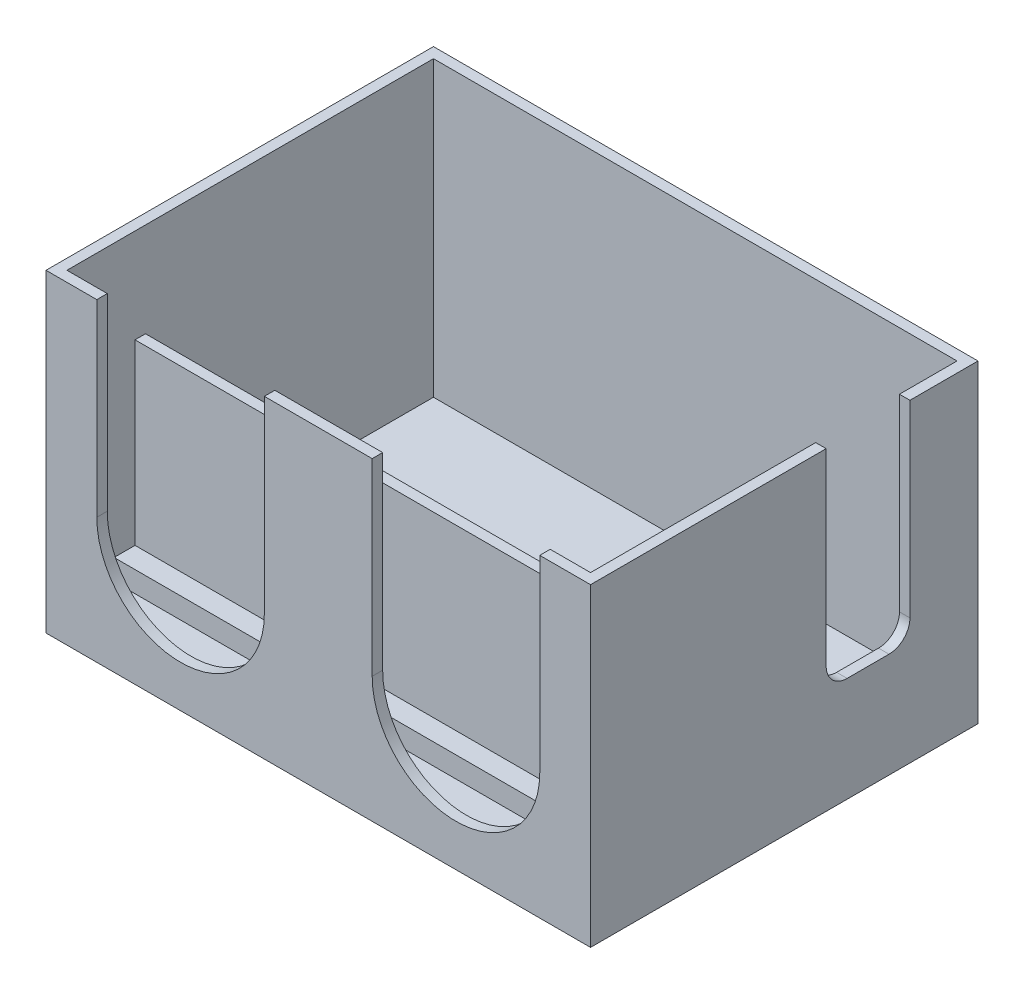
ISO-10303-21;
HEADER;
FILE_DESCRIPTION(('STEP AP214'),'2;1');
FILE_NAME('part.step','',(''),(''),'','','');
FILE_SCHEMA(('AUTOMOTIVE_DESIGN { 1 0 10303 214 1 1 1 1 }'));
ENDSEC;
DATA;
#1=APPLICATION_CONTEXT('core data for automotive mechanical design processes');
#2=APPLICATION_PROTOCOL_DEFINITION('international standard','automotive_design',2000,#1);
#3=PRODUCT_CONTEXT('',#1,'mechanical');
#4=PRODUCT('Part','Part','',(#3));
#5=PRODUCT_RELATED_PRODUCT_CATEGORY('part','',(#4));
#6=PRODUCT_DEFINITION_FORMATION('','',#4);
#7=PRODUCT_DEFINITION_CONTEXT('part definition',#1,'design');
#8=PRODUCT_DEFINITION('design','',#6,#7);
#9=PRODUCT_DEFINITION_SHAPE('','',#8);
#10=(LENGTH_UNIT() NAMED_UNIT(*) SI_UNIT(.MILLI.,.METRE.));
#11=(NAMED_UNIT(*) PLANE_ANGLE_UNIT() SI_UNIT($,.RADIAN.));
#12=(NAMED_UNIT(*) SI_UNIT($,.STERADIAN.) SOLID_ANGLE_UNIT());
#13=UNCERTAINTY_MEASURE_WITH_UNIT(LENGTH_MEASURE(1.E-05),#10,'distance_accuracy_value','');
#14=(GEOMETRIC_REPRESENTATION_CONTEXT(3) GLOBAL_UNCERTAINTY_ASSIGNED_CONTEXT((#13)) GLOBAL_UNIT_ASSIGNED_CONTEXT((#10,
#11,#12)) REPRESENTATION_CONTEXT('',''));
#15=CARTESIAN_POINT('',(0.,0.,0.));
#16=DIRECTION('',(0.,0.,1.));
#17=DIRECTION('',(1.,0.,0.));
#18=AXIS2_PLACEMENT_3D('',#15,#16,#17);
#19=CARTESIAN_POINT('',(0.999999999999999,30.,-0.999999999999992));
#20=DIRECTION('',(1.,0.,0.));
#21=DIRECTION('',(0.,0.,-1.));
#22=AXIS2_PLACEMENT_3D('',#19,#20,#21);
#23=PLANE('',#22);
#24=DIRECTION('',(0.,0.,1.));
#25=VECTOR('',#24,1.);
#26=CARTESIAN_POINT('',(0.999999999999997,21.,-7.49999999999999));
#27=LINE('',#26,#25);
#28=CARTESIAN_POINT('',(0.999999999999998,21.,-8.49999999999999));
#29=VERTEX_POINT('',#28);
#30=CARTESIAN_POINT('',(0.999999999999997,21.,-7.49999999999999));
#31=VERTEX_POINT('',#30);
#32=EDGE_CURVE('E276',#29,#31,#27,.T.);
#33=ORIENTED_EDGE('',*,*,#32,.F.);
#34=DIRECTION('',(0.,-1.,0.));
#35=VECTOR('',#34,1.);
#36=CARTESIAN_POINT('',(0.999999999999998,21.,-8.49999999999999));
#37=LINE('',#36,#35);
#38=CARTESIAN_POINT('',(0.999999999999998,2.,-8.49999999999999));
#39=VERTEX_POINT('',#38);
#40=EDGE_CURVE('E273',#29,#39,#37,.T.);
#41=ORIENTED_EDGE('',*,*,#40,.T.);
#42=DIRECTION('',(0.,0.,1.));
#43=VECTOR('',#42,1.);
#44=CARTESIAN_POINT('',(0.999999999999999,2.,-0.999999999999992));
#45=LINE('',#44,#43);
#46=CARTESIAN_POINT('',(0.999999999999998,2.,-13.5));
#47=VERTEX_POINT('',#46);
#48=EDGE_CURVE('E603',#47,#39,#45,.T.);
#49=ORIENTED_EDGE('',*,*,#48,.F.);
#50=DIRECTION('',(0.,-1.,0.));
#51=VECTOR('',#50,1.);
#52=CARTESIAN_POINT('',(0.999999999999996,4.,-13.5));
#53=LINE('',#52,#51);
#54=CARTESIAN_POINT('',(0.999999999999996,4.,-13.5));
#55=VERTEX_POINT('',#54);
#56=EDGE_CURVE('E376',#55,#47,#53,.T.);
#57=ORIENTED_EDGE('',*,*,#56,.F.);
#58=DIRECTION('',(0.,0.,1.));
#59=VECTOR('',#58,1.);
#60=CARTESIAN_POINT('',(0.999999999999996,4.,-13.5));
#61=LINE('',#60,#59);
#62=CARTESIAN_POINT('',(0.999999999999996,4.,-15.5));
#63=VERTEX_POINT('',#62);
#64=EDGE_CURVE('E366',#63,#55,#61,.T.);
#65=ORIENTED_EDGE('',*,*,#64,.F.);
#66=DIRECTION('',(0.,-1.,0.));
#67=VECTOR('',#66,1.);
#68=CARTESIAN_POINT('',(0.999999999999996,4.,-15.5));
#69=LINE('',#68,#67);
#70=CARTESIAN_POINT('',(0.999999999999996,2.,-15.5));
#71=VERTEX_POINT('',#70);
#72=EDGE_CURVE('E378',#63,#71,#69,.T.);
#73=ORIENTED_EDGE('',*,*,#72,.T.);
#74=CARTESIAN_POINT('',(0.999999999999997,2.,-17.25));
#75=VERTEX_POINT('',#74);
#76=EDGE_CURVE('E448',#75,#71,#45,.T.);
#77=ORIENTED_EDGE('',*,*,#76,.F.);
#78=DIRECTION('',(0.,-1.,0.));
#79=VECTOR('',#78,1.);
#80=CARTESIAN_POINT('',(0.999999999999996,4.,-17.25));
#81=LINE('',#80,#79);
#82=CARTESIAN_POINT('',(0.999999999999996,4.,-17.25));
#83=VERTEX_POINT('',#82);
#84=EDGE_CURVE('E56',#83,#75,#81,.T.);
#85=ORIENTED_EDGE('',*,*,#84,.F.);
#86=DIRECTION('',(0.,0.,1.));
#87=VECTOR('',#86,1.);
#88=CARTESIAN_POINT('',(0.999999999999996,4.,-17.25));
#89=LINE('',#88,#87);
#90=CARTESIAN_POINT('',(0.999999999999996,4.,-19.25));
#91=VERTEX_POINT('',#90);
#92=EDGE_CURVE('E344',#91,#83,#89,.T.);
#93=ORIENTED_EDGE('',*,*,#92,.F.);
#94=DIRECTION('',(0.,-1.,0.));
#95=VECTOR('',#94,1.);
#96=CARTESIAN_POINT('',(0.999999999999996,4.,-19.25));
#97=LINE('',#96,#95);
#98=CARTESIAN_POINT('',(0.999999999999996,2.,-19.25));
#99=VERTEX_POINT('',#98);
#100=EDGE_CURVE('E354',#91,#99,#97,.T.);
#101=ORIENTED_EDGE('',*,*,#100,.T.);
#102=CARTESIAN_POINT('',(0.999999999999996,2.,-36.));
#103=VERTEX_POINT('',#102);
#104=EDGE_CURVE('E444',#103,#99,#45,.T.);
#105=ORIENTED_EDGE('',*,*,#104,.F.);
#106=DIRECTION('',(0.,-1.,0.));
#107=VECTOR('',#106,1.);
#108=CARTESIAN_POINT('',(0.999999999999996,30.,-36.));
#109=LINE('',#108,#107);
#110=CARTESIAN_POINT('',(0.999999999999996,30.,-36.));
#111=VERTEX_POINT('',#110);
#112=EDGE_CURVE('E461',#111,#103,#109,.T.);
#113=ORIENTED_EDGE('',*,*,#112,.F.);
#114=DIRECTION('',(0.,0.,1.));
#115=VECTOR('',#114,1.);
#116=CARTESIAN_POINT('',(0.999999999999999,30.,-0.999999999999992));
#117=LINE('',#116,#115);
#118=CARTESIAN_POINT('',(0.999999999999999,30.,-0.999999999999992));
#119=VERTEX_POINT('',#118);
#120=EDGE_CURVE('E447',#111,#119,#117,.T.);
#121=ORIENTED_EDGE('',*,*,#120,.T.);
#122=DIRECTION('',(0.,-1.,0.));
#123=VECTOR('',#122,1.);
#124=CARTESIAN_POINT('',(0.999999999999999,30.,-0.999999999999992));
#125=LINE('',#124,#123);
#126=CARTESIAN_POINT('',(0.999999999999999,2.,-0.999999999999992));
#127=VERTEX_POINT('',#126);
#128=EDGE_CURVE('E469',#119,#127,#125,.T.);
#129=ORIENTED_EDGE('',*,*,#128,.T.);
#130=CARTESIAN_POINT('',(0.999999999999996,2.,-5.49999999999999));
#131=VERTEX_POINT('',#130);
#132=EDGE_CURVE('E443',#131,#127,#45,.T.);
#133=ORIENTED_EDGE('',*,*,#132,.F.);
#134=DIRECTION('',(0.,-1.,0.));
#135=VECTOR('',#134,1.);
#136=CARTESIAN_POINT('',(0.999999999999996,4.,-5.49999999999999));
#137=LINE('',#136,#135);
#138=CARTESIAN_POINT('',(0.999999999999996,4.,-5.49999999999999));
#139=VERTEX_POINT('',#138);
#140=EDGE_CURVE('E399',#139,#131,#137,.T.);
#141=ORIENTED_EDGE('',*,*,#140,.F.);
#142=DIRECTION('',(0.,0.,1.));
#143=VECTOR('',#142,1.);
#144=CARTESIAN_POINT('',(0.999999999999996,4.,-5.49999999999999));
#145=LINE('',#144,#143);
#146=CARTESIAN_POINT('',(0.999999999999996,4.,-7.49999999999999));
#147=VERTEX_POINT('',#146);
#148=EDGE_CURVE('E384',#147,#139,#145,.T.);
#149=ORIENTED_EDGE('',*,*,#148,.F.);
#150=DIRECTION('',(0.,-1.,0.));
#151=VECTOR('',#150,1.);
#152=CARTESIAN_POINT('',(0.999999999999997,21.,-7.49999999999999));
#153=LINE('',#152,#151);
#154=EDGE_CURVE('E297',#31,#147,#153,.T.);
#155=ORIENTED_EDGE('',*,*,#154,.F.);
#156=EDGE_LOOP('',(#33,#41,#49,#57,#65,#73,#77,#85,#93,#101,#105,#113,#121,#129,#133,#141,#149,#155));
#157=FACE_BOUND('',#156,.T.);
#158=ADVANCED_FACE('F33',(#157),#23,.T.);
#159=CARTESIAN_POINT('',(51.,30.,-0.999999999999995));
#160=DIRECTION('',(-1.,0.,0.));
#161=DIRECTION('',(0.,0.,1.));
#162=AXIS2_PLACEMENT_3D('',#159,#160,#161);
#163=PLANE('',#162);
#164=DIRECTION('',(0.,0.,-1.));
#165=VECTOR('',#164,1.);
#166=CARTESIAN_POINT('',(51.,2.,-0.999999999999995));
#167=LINE('',#166,#165);
#168=CARTESIAN_POINT('',(51.,2.,-8.49999999999999));
#169=VERTEX_POINT('',#168);
#170=CARTESIAN_POINT('',(51.,2.,-13.5));
#171=VERTEX_POINT('',#170);
#172=EDGE_CURVE('E291',#169,#171,#167,.T.);
#173=ORIENTED_EDGE('',*,*,#172,.F.);
#174=DIRECTION('',(0.,-1.,0.));
#175=VECTOR('',#174,1.);
#176=CARTESIAN_POINT('',(51.,21.,-8.49999999999999));
#177=LINE('',#176,#175);
#178=CARTESIAN_POINT('',(51.,21.,-8.49999999999999));
#179=VERTEX_POINT('',#178);
#180=EDGE_CURVE('E270',#179,#169,#177,.T.);
#181=ORIENTED_EDGE('',*,*,#180,.F.);
#182=DIRECTION('',(0.,0.,-1.));
#183=VECTOR('',#182,1.);
#184=CARTESIAN_POINT('',(51.,21.,-7.49999999999999));
#185=LINE('',#184,#183);
#186=CARTESIAN_POINT('',(51.,21.,-7.49999999999999));
#187=VERTEX_POINT('',#186);
#188=EDGE_CURVE('E277',#187,#179,#185,.T.);
#189=ORIENTED_EDGE('',*,*,#188,.F.);
#190=DIRECTION('',(0.,-1.,0.));
#191=VECTOR('',#190,1.);
#192=CARTESIAN_POINT('',(51.,21.,-7.49999999999999));
#193=LINE('',#192,#191);
#194=CARTESIAN_POINT('',(51.,4.,-7.49999999999999));
#195=VERTEX_POINT('',#194);
#196=EDGE_CURVE('E713',#187,#195,#193,.T.);
#197=ORIENTED_EDGE('',*,*,#196,.T.);
#198=DIRECTION('',(0.,0.,-1.));
#199=VECTOR('',#198,1.);
#200=CARTESIAN_POINT('',(51.,4.,-5.49999999999999));
#201=LINE('',#200,#199);
#202=CARTESIAN_POINT('',(51.,4.,-5.49999999999999));
#203=VERTEX_POINT('',#202);
#204=EDGE_CURVE('E389',#203,#195,#201,.T.);
#205=ORIENTED_EDGE('',*,*,#204,.F.);
#206=DIRECTION('',(0.,-1.,0.));
#207=VECTOR('',#206,1.);
#208=CARTESIAN_POINT('',(51.,4.,-5.49999999999999));
#209=LINE('',#208,#207);
#210=CARTESIAN_POINT('',(51.,2.,-5.49999999999999));
#211=VERTEX_POINT('',#210);
#212=EDGE_CURVE('E395',#203,#211,#209,.T.);
#213=ORIENTED_EDGE('',*,*,#212,.T.);
#214=CARTESIAN_POINT('',(51.,2.,-0.999999999999995));
#215=VERTEX_POINT('',#214);
#216=EDGE_CURVE('E436',#215,#211,#167,.T.);
#217=ORIENTED_EDGE('',*,*,#216,.F.);
#218=DIRECTION('',(0.,-1.,0.));
#219=VECTOR('',#218,1.);
#220=CARTESIAN_POINT('',(51.,30.,-0.999999999999995));
#221=LINE('',#220,#219);
#222=CARTESIAN_POINT('',(51.,30.,-0.999999999999995));
#223=VERTEX_POINT('',#222);
#224=EDGE_CURVE('E466',#223,#215,#221,.T.);
#225=ORIENTED_EDGE('',*,*,#224,.F.);
#226=DIRECTION('',(0.,0.,-1.));
#227=VECTOR('',#226,1.);
#228=CARTESIAN_POINT('',(51.,30.,-0.999999999999995));
#229=LINE('',#228,#227);
#230=CARTESIAN_POINT('',(51.,30.,-22.5));
#231=VERTEX_POINT('',#230);
#232=EDGE_CURVE('E456',#223,#231,#229,.T.);
#233=ORIENTED_EDGE('',*,*,#232,.T.);
#234=DIRECTION('',(0.,-1.,0.));
#235=VECTOR('',#234,1.);
#236=CARTESIAN_POINT('',(51.,30.,-22.5));
#237=LINE('',#236,#235);
#238=CARTESIAN_POINT('',(51.,12.,-22.5));
#239=VERTEX_POINT('',#238);
#240=EDGE_CURVE('E327',#231,#239,#237,.T.);
#241=ORIENTED_EDGE('',*,*,#240,.T.);
#242=CARTESIAN_POINT('',(51.,12.,-24.5));
#243=DIRECTION('',(-1.,0.,0.));
#244=DIRECTION('',(0.,0.,1.));
#245=AXIS2_PLACEMENT_3D('',#242,#243,#244);
#246=CIRCLE('',#245,2.);
#247=CARTESIAN_POINT('',(51.,9.99999999999999,-24.5));
#248=VERTEX_POINT('',#247);
#249=EDGE_CURVE('E323',#239,#248,#246,.F.);
#250=ORIENTED_EDGE('',*,*,#249,.T.);
#251=DIRECTION('',(0.,0.,-1.));
#252=VECTOR('',#251,1.);
#253=CARTESIAN_POINT('',(51.,10.,-28.5));
#254=LINE('',#253,#252);
#255=CARTESIAN_POINT('',(51.,10.,-28.5));
#256=VERTEX_POINT('',#255);
#257=EDGE_CURVE('E319',#248,#256,#254,.T.);
#258=ORIENTED_EDGE('',*,*,#257,.T.);
#259=CARTESIAN_POINT('',(51.,12.,-28.5));
#260=DIRECTION('',(-1.,0.,0.));
#261=DIRECTION('',(0.,0.,1.));
#262=AXIS2_PLACEMENT_3D('',#259,#260,#261);
#263=CIRCLE('',#262,2.);
#264=CARTESIAN_POINT('',(51.,12.,-30.5));
#265=VERTEX_POINT('',#264);
#266=EDGE_CURVE('E315',#256,#265,#263,.F.);
#267=ORIENTED_EDGE('',*,*,#266,.T.);
#268=DIRECTION('',(0.,1.,0.));
#269=VECTOR('',#268,1.);
#270=CARTESIAN_POINT('',(51.,30.,-30.5));
#271=LINE('',#270,#269);
#272=CARTESIAN_POINT('',(51.,30.,-30.5));
#273=VERTEX_POINT('',#272);
#274=EDGE_CURVE('E292',#265,#273,#271,.T.);
#275=ORIENTED_EDGE('',*,*,#274,.T.);
#276=CARTESIAN_POINT('',(51.,30.,-36.));
#277=VERTEX_POINT('',#276);
#278=EDGE_CURVE('E454',#273,#277,#229,.T.);
#279=ORIENTED_EDGE('',*,*,#278,.T.);
#280=DIRECTION('',(0.,-1.,0.));
#281=VECTOR('',#280,1.);
#282=CARTESIAN_POINT('',(51.,30.,-36.));
#283=LINE('',#282,#281);
#284=CARTESIAN_POINT('',(51.,2.,-36.));
#285=VERTEX_POINT('',#284);
#286=EDGE_CURVE('E463',#277,#285,#283,.T.);
#287=ORIENTED_EDGE('',*,*,#286,.T.);
#288=CARTESIAN_POINT('',(51.,2.,-19.25));
#289=VERTEX_POINT('',#288);
#290=EDGE_CURVE('E414',#289,#285,#167,.T.);
#291=ORIENTED_EDGE('',*,*,#290,.F.);
#292=DIRECTION('',(0.,-1.,0.));
#293=VECTOR('',#292,1.);
#294=CARTESIAN_POINT('',(51.,4.,-19.25));
#295=LINE('',#294,#293);
#296=CARTESIAN_POINT('',(51.,4.,-19.25));
#297=VERTEX_POINT('',#296);
#298=EDGE_CURVE('E357',#297,#289,#295,.T.);
#299=ORIENTED_EDGE('',*,*,#298,.F.);
#300=DIRECTION('',(0.,0.,-1.));
#301=VECTOR('',#300,1.);
#302=CARTESIAN_POINT('',(51.,4.,-17.25));
#303=LINE('',#302,#301);
#304=CARTESIAN_POINT('',(51.,4.,-17.25));
#305=VERTEX_POINT('',#304);
#306=EDGE_CURVE('E338',#305,#297,#303,.T.);
#307=ORIENTED_EDGE('',*,*,#306,.F.);
#308=DIRECTION('',(0.,-1.,0.));
#309=VECTOR('',#308,1.);
#310=CARTESIAN_POINT('',(51.,4.,-17.25));
#311=LINE('',#310,#309);
#312=CARTESIAN_POINT('',(51.,2.,-17.25));
#313=VERTEX_POINT('',#312);
#314=EDGE_CURVE('E348',#305,#313,#311,.T.);
#315=ORIENTED_EDGE('',*,*,#314,.T.);
#316=CARTESIAN_POINT('',(51.,2.,-15.5));
#317=VERTEX_POINT('',#316);
#318=EDGE_CURVE('E440',#317,#313,#167,.T.);
#319=ORIENTED_EDGE('',*,*,#318,.F.);
#320=DIRECTION('',(0.,-1.,0.));
#321=VECTOR('',#320,1.);
#322=CARTESIAN_POINT('',(51.,4.,-15.5));
#323=LINE('',#322,#321);
#324=CARTESIAN_POINT('',(51.,4.,-15.5));
#325=VERTEX_POINT('',#324);
#326=EDGE_CURVE('E381',#325,#317,#323,.T.);
#327=ORIENTED_EDGE('',*,*,#326,.F.);
#328=DIRECTION('',(0.,0.,-1.));
#329=VECTOR('',#328,1.);
#330=CARTESIAN_POINT('',(51.,4.,-13.5));
#331=LINE('',#330,#329);
#332=CARTESIAN_POINT('',(51.,4.,-13.5));
#333=VERTEX_POINT('',#332);
#334=EDGE_CURVE('E360',#333,#325,#331,.T.);
#335=ORIENTED_EDGE('',*,*,#334,.F.);
#336=DIRECTION('',(0.,-1.,0.));
#337=VECTOR('',#336,1.);
#338=CARTESIAN_POINT('',(51.,4.,-13.5));
#339=LINE('',#338,#337);
#340=EDGE_CURVE('E370',#333,#171,#339,.T.);
#341=ORIENTED_EDGE('',*,*,#340,.T.);
#342=EDGE_LOOP('',(#173,#181,#189,#197,#205,#213,#217,#225,#233,#241,#250,#258,#267,#275,#279,
#287,#291,#299,#307,#315,#319,#327,#335,#341));
#343=FACE_BOUND('',#342,.T.);
#344=ADVANCED_FACE('F289',(#343),#163,.T.);
#345=CARTESIAN_POINT('',(0.,2.,0.));
#346=DIRECTION('',(0.,1.,0.));
#347=DIRECTION('',(0.,0.,1.));
#348=AXIS2_PLACEMENT_3D('',#345,#346,#347);
#349=PLANE('',#348);
#350=ORIENTED_EDGE('',*,*,#48,.T.);
#351=DIRECTION('',(-1.,0.,0.));
#352=VECTOR('',#351,1.);
#353=CARTESIAN_POINT('',(51.,2.,-8.49999999999999));
#354=LINE('',#353,#352);
#355=EDGE_CURVE('E286',#169,#39,#354,.T.);
#356=ORIENTED_EDGE('',*,*,#355,.F.);
#357=ORIENTED_EDGE('',*,*,#172,.T.);
#358=DIRECTION('',(1.,0.,0.));
#359=VECTOR('',#358,1.);
#360=CARTESIAN_POINT('',(51.,2.,-13.5));
#361=LINE('',#360,#359);
#362=EDGE_CURVE('E364',#47,#171,#361,.T.);
#363=ORIENTED_EDGE('',*,*,#362,.F.);
#364=EDGE_LOOP('',(#350,#356,#357,#363));
#365=FACE_BOUND('',#364,.T.);
#366=ADVANCED_FACE('F589',(#365),#349,.T.);
#367=CARTESIAN_POINT('',(0.,30.,0.));
#368=DIRECTION('',(0.,-1.,0.));
#369=DIRECTION('',(0.,0.,-1.));
#370=AXIS2_PLACEMENT_3D('',#367,#368,#369);
#371=PLANE('',#370);
#372=ORIENTED_EDGE('',*,*,#278,.F.);
#373=DIRECTION('',(1.,0.,0.));
#374=VECTOR('',#373,1.);
#375=CARTESIAN_POINT('',(-0.001000000000001,30.,-30.5));
#376=LINE('',#375,#374);
#377=CARTESIAN_POINT('',(52.,30.,-30.5));
#378=VERTEX_POINT('',#377);
#379=EDGE_CURVE('E295',#273,#378,#376,.T.);
#380=ORIENTED_EDGE('',*,*,#379,.T.);
#381=DIRECTION('',(0.,0.,-1.));
#382=VECTOR('',#381,1.);
#383=CARTESIAN_POINT('',(52.,30.,0.));
#384=LINE('',#383,#382);
#385=CARTESIAN_POINT('',(52.,30.,-37.));
#386=VERTEX_POINT('',#385);
#387=EDGE_CURVE('E481',#378,#386,#384,.T.);
#388=ORIENTED_EDGE('',*,*,#387,.T.);
#389=DIRECTION('',(-1.,0.,0.));
#390=VECTOR('',#389,1.);
#391=CARTESIAN_POINT('',(0.,30.,-37.));
#392=LINE('',#391,#390);
#393=CARTESIAN_POINT('',(0.,30.,-37.));
#394=VERTEX_POINT('',#393);
#395=EDGE_CURVE('E486',#386,#394,#392,.T.);
#396=ORIENTED_EDGE('',*,*,#395,.T.);
#397=DIRECTION('',(0.,0.,1.));
#398=VECTOR('',#397,1.);
#399=CARTESIAN_POINT('',(0.,30.,0.));
#400=LINE('',#399,#398);
#401=CARTESIAN_POINT('',(0.,30.,0.));
#402=VERTEX_POINT('',#401);
#403=EDGE_CURVE('E473',#394,#402,#400,.T.);
#404=ORIENTED_EDGE('',*,*,#403,.T.);
#405=DIRECTION('',(1.,0.,0.));
#406=VECTOR('',#405,1.);
#407=CARTESIAN_POINT('',(0.,30.,0.));
#408=LINE('',#407,#406);
#409=CARTESIAN_POINT('',(4.84999999999999,30.,0.));
#410=VERTEX_POINT('',#409);
#411=EDGE_CURVE('E478',#402,#410,#408,.T.);
#412=ORIENTED_EDGE('',*,*,#411,.T.);
#413=DIRECTION('',(0.,0.,1.));
#414=VECTOR('',#413,1.);
#415=CARTESIAN_POINT('',(4.84999999999999,30.,-2.));
#416=LINE('',#415,#414);
#417=CARTESIAN_POINT('',(4.84999999999999,30.,-0.999999999999993));
#418=VERTEX_POINT('',#417);
#419=EDGE_CURVE('E430',#418,#410,#416,.T.);
#420=ORIENTED_EDGE('',*,*,#419,.F.);
#421=DIRECTION('',(1.,0.,0.));
#422=VECTOR('',#421,1.);
#423=CARTESIAN_POINT('',(0.999999999999999,30.,-0.999999999999992));
#424=LINE('',#423,#422);
#425=EDGE_CURVE('E451',#119,#418,#424,.T.);
#426=ORIENTED_EDGE('',*,*,#425,.F.);
#427=ORIENTED_EDGE('',*,*,#120,.F.);
#428=DIRECTION('',(-1.,0.,0.));
#429=VECTOR('',#428,1.);
#430=CARTESIAN_POINT('',(0.999999999999996,30.,-36.));
#431=LINE('',#430,#429);
#432=EDGE_CURVE('E459',#277,#111,#431,.T.);
#433=ORIENTED_EDGE('',*,*,#432,.F.);
#434=EDGE_LOOP('',(#372,#380,#388,#396,#404,#412,#420,#426,#427,#433));
#435=FACE_BOUND('',#434,.T.);
#436=ADVANCED_FACE('F567',(#435),#371,.F.);
#437=ORIENTED_EDGE('',*,*,#104,.T.);
#438=DIRECTION('',(-1.,0.,0.));
#439=VECTOR('',#438,1.);
#440=CARTESIAN_POINT('',(51.,2.,-19.25));
#441=LINE('',#440,#439);
#442=EDGE_CURVE('E304',#289,#99,#441,.T.);
#443=ORIENTED_EDGE('',*,*,#442,.F.);
#444=ORIENTED_EDGE('',*,*,#290,.T.);
#445=DIRECTION('',(-1.,0.,0.));
#446=VECTOR('',#445,1.);
#447=CARTESIAN_POINT('',(0.999999999999996,2.,-36.));
#448=LINE('',#447,#446);
#449=EDGE_CURVE('E506',#285,#103,#448,.T.);
#450=ORIENTED_EDGE('',*,*,#449,.T.);
#451=EDGE_LOOP('',(#437,#443,#444,#450));
#452=FACE_BOUND('',#451,.T.);
#453=ADVANCED_FACE('F581',(#452),#349,.T.);
#454=ORIENTED_EDGE('',*,*,#318,.T.);
#455=DIRECTION('',(1.,0.,0.));
#456=VECTOR('',#455,1.);
#457=CARTESIAN_POINT('',(51.,2.,-17.25));
#458=LINE('',#457,#456);
#459=EDGE_CURVE('E342',#75,#313,#458,.T.);
#460=ORIENTED_EDGE('',*,*,#459,.F.);
#461=ORIENTED_EDGE('',*,*,#76,.T.);
#462=DIRECTION('',(-1.,0.,0.));
#463=VECTOR('',#462,1.);
#464=CARTESIAN_POINT('',(51.,2.,-15.5));
#465=LINE('',#464,#463);
#466=EDGE_CURVE('E359',#317,#71,#465,.T.);
#467=ORIENTED_EDGE('',*,*,#466,.F.);
#468=EDGE_LOOP('',(#454,#460,#461,#467));
#469=FACE_BOUND('',#468,.T.);
#470=ADVANCED_FACE('F942',(#469),#349,.T.);
#471=ORIENTED_EDGE('',*,*,#216,.T.);
#472=DIRECTION('',(1.,0.,0.));
#473=VECTOR('',#472,1.);
#474=CARTESIAN_POINT('',(0.999999999999996,2.,-5.49999999999999));
#475=LINE('',#474,#473);
#476=EDGE_CURVE('E383',#131,#211,#475,.T.);
#477=ORIENTED_EDGE('',*,*,#476,.F.);
#478=ORIENTED_EDGE('',*,*,#132,.T.);
#479=DIRECTION('',(1.,0.,0.));
#480=VECTOR('',#479,1.);
#481=CARTESIAN_POINT('',(0.999999999999999,2.,-0.999999999999992));
#482=LINE('',#481,#480);
#483=EDGE_CURVE('E439',#127,#215,#482,.T.);
#484=ORIENTED_EDGE('',*,*,#483,.T.);
#485=EDGE_LOOP('',(#471,#477,#478,#484));
#486=FACE_BOUND('',#485,.T.);
#487=ADVANCED_FACE('F607',(#486),#349,.T.);
#488=CARTESIAN_POINT('',(20.85,30.,0.));
#489=VERTEX_POINT('',#488);
#490=CARTESIAN_POINT('',(31.15,30.,0.));
#491=VERTEX_POINT('',#490);
#492=EDGE_CURVE('E482',#489,#491,#408,.T.);
#493=ORIENTED_EDGE('',*,*,#492,.T.);
#494=DIRECTION('',(0.,0.,1.));
#495=VECTOR('',#494,1.);
#496=CARTESIAN_POINT('',(31.15,30.,-2.));
#497=LINE('',#496,#495);
#498=CARTESIAN_POINT('',(31.15,30.,-0.999999999999995));
#499=VERTEX_POINT('',#498);
#500=EDGE_CURVE('E415',#499,#491,#497,.T.);
#501=ORIENTED_EDGE('',*,*,#500,.F.);
#502=CARTESIAN_POINT('',(20.85,30.,-0.999999999999994));
#503=VERTEX_POINT('',#502);
#504=EDGE_CURVE('E455',#503,#499,#424,.T.);
#505=ORIENTED_EDGE('',*,*,#504,.F.);
#506=DIRECTION('',(0.,0.,1.));
#507=VECTOR('',#506,1.);
#508=CARTESIAN_POINT('',(20.85,30.,-2.));
#509=LINE('',#508,#507);
#510=EDGE_CURVE('E432',#503,#489,#509,.T.);
#511=ORIENTED_EDGE('',*,*,#510,.T.);
#512=EDGE_LOOP('',(#493,#501,#505,#511));
#513=FACE_BOUND('',#512,.T.);
#514=ADVANCED_FACE('F626',(#513),#371,.F.);
#515=CARTESIAN_POINT('',(52.,30.,0.));
#516=VERTEX_POINT('',#515);
#517=CARTESIAN_POINT('',(52.,30.,-22.5));
#518=VERTEX_POINT('',#517);
#519=EDGE_CURVE('E483',#516,#518,#384,.T.);
#520=ORIENTED_EDGE('',*,*,#519,.T.);
#521=DIRECTION('',(1.,0.,0.));
#522=VECTOR('',#521,1.);
#523=CARTESIAN_POINT('',(-0.001000000000001,30.,-22.5));
#524=LINE('',#523,#522);
#525=EDGE_CURVE('E48',#231,#518,#524,.T.);
#526=ORIENTED_EDGE('',*,*,#525,.F.);
#527=ORIENTED_EDGE('',*,*,#232,.F.);
#528=CARTESIAN_POINT('',(47.15,30.,-0.999999999999995));
#529=VERTEX_POINT('',#528);
#530=EDGE_CURVE('E450',#529,#223,#424,.T.);
#531=ORIENTED_EDGE('',*,*,#530,.F.);
#532=DIRECTION('',(0.,0.,1.));
#533=VECTOR('',#532,1.);
#534=CARTESIAN_POINT('',(47.15,30.,-2.));
#535=LINE('',#534,#533);
#536=CARTESIAN_POINT('',(47.15,30.,0.));
#537=VERTEX_POINT('',#536);
#538=EDGE_CURVE('E417',#529,#537,#535,.T.);
#539=ORIENTED_EDGE('',*,*,#538,.T.);
#540=EDGE_CURVE('E476',#537,#516,#408,.T.);
#541=ORIENTED_EDGE('',*,*,#540,.T.);
#542=EDGE_LOOP('',(#520,#526,#527,#531,#539,#541));
#543=FACE_BOUND('',#542,.T.);
#544=ADVANCED_FACE('F540',(#543),#371,.F.);
#545=CARTESIAN_POINT('',(0.,0.,0.));
#546=DIRECTION('',(0.,-1.,0.));
#547=DIRECTION('',(0.,0.,-1.));
#548=AXIS2_PLACEMENT_3D('',#545,#546,#547);
#549=PLANE('',#548);
#550=DIRECTION('',(0.,0.,1.));
#551=VECTOR('',#550,1.);
#552=CARTESIAN_POINT('',(0.,0.,0.));
#553=LINE('',#552,#551);
#554=CARTESIAN_POINT('',(0.,0.,-37.));
#555=VERTEX_POINT('',#554);
#556=CARTESIAN_POINT('',(0.,0.,0.));
#557=VERTEX_POINT('',#556);
#558=EDGE_CURVE('E472',#555,#557,#553,.T.);
#559=ORIENTED_EDGE('',*,*,#558,.F.);
#560=DIRECTION('',(-1.,0.,0.));
#561=VECTOR('',#560,1.);
#562=CARTESIAN_POINT('',(0.,0.,-37.));
#563=LINE('',#562,#561);
#564=CARTESIAN_POINT('',(52.,0.,-37.));
#565=VERTEX_POINT('',#564);
#566=EDGE_CURVE('E477',#565,#555,#563,.T.);
#567=ORIENTED_EDGE('',*,*,#566,.F.);
#568=DIRECTION('',(0.,0.,-1.));
#569=VECTOR('',#568,1.);
#570=CARTESIAN_POINT('',(52.,0.,0.));
#571=LINE('',#570,#569);
#572=CARTESIAN_POINT('',(52.,0.,0.));
#573=VERTEX_POINT('',#572);
#574=EDGE_CURVE('E494',#573,#565,#571,.T.);
#575=ORIENTED_EDGE('',*,*,#574,.F.);
#576=DIRECTION('',(1.,0.,0.));
#577=VECTOR('',#576,1.);
#578=CARTESIAN_POINT('',(0.,0.,0.));
#579=LINE('',#578,#577);
#580=EDGE_CURVE('E491',#557,#573,#579,.T.);
#581=ORIENTED_EDGE('',*,*,#580,.F.);
#582=EDGE_LOOP('',(#559,#567,#575,#581));
#583=FACE_BOUND('',#582,.T.);
#584=ADVANCED_FACE('F652',(#583),#549,.T.);
#585=CARTESIAN_POINT('',(0.,30.,0.));
#586=DIRECTION('',(1.,0.,0.));
#587=DIRECTION('',(0.,0.,-1.));
#588=AXIS2_PLACEMENT_3D('',#585,#586,#587);
#589=PLANE('',#588);
#590=DIRECTION('',(0.,-1.,0.));
#591=VECTOR('',#590,1.);
#592=CARTESIAN_POINT('',(0.,30.,-37.));
#593=LINE('',#592,#591);
#594=EDGE_CURVE('E488',#394,#555,#593,.T.);
#595=ORIENTED_EDGE('',*,*,#594,.T.);
#596=ORIENTED_EDGE('',*,*,#558,.T.);
#597=DIRECTION('',(0.,-1.,0.));
#598=VECTOR('',#597,1.);
#599=CARTESIAN_POINT('',(0.,30.,0.));
#600=LINE('',#599,#598);
#601=EDGE_CURVE('E504',#402,#557,#600,.T.);
#602=ORIENTED_EDGE('',*,*,#601,.F.);
#603=ORIENTED_EDGE('',*,*,#403,.F.);
#604=EDGE_LOOP('',(#595,#596,#602,#603));
#605=FACE_BOUND('',#604,.T.);
#606=ADVANCED_FACE('F35',(#605),#589,.F.);
#607=CARTESIAN_POINT('',(0.,30.,0.));
#608=DIRECTION('',(0.,0.,-1.));
#609=DIRECTION('',(-1.,0.,0.));
#610=AXIS2_PLACEMENT_3D('',#607,#608,#609);
#611=PLANE('',#610);
#612=CARTESIAN_POINT('',(39.15,12.,0.));
#613=DIRECTION('',(0.,0.,1.));
#614=DIRECTION('',(1.,0.,0.));
#615=AXIS2_PLACEMENT_3D('',#612,#613,#614);
#616=CIRCLE('',#615,8.);
#617=CARTESIAN_POINT('',(31.15,12.,0.));
#618=VERTEX_POINT('',#617);
#619=CARTESIAN_POINT('',(47.15,12.,0.));
#620=VERTEX_POINT('',#619);
#621=EDGE_CURVE('E402',#618,#620,#616,.T.);
#622=ORIENTED_EDGE('',*,*,#621,.F.);
#623=DIRECTION('',(0.,-1.,0.));
#624=VECTOR('',#623,1.);
#625=CARTESIAN_POINT('',(31.15,12.,0.));
#626=LINE('',#625,#624);
#627=EDGE_CURVE('E408',#491,#618,#626,.T.);
#628=ORIENTED_EDGE('',*,*,#627,.F.);
#629=ORIENTED_EDGE('',*,*,#492,.F.);
#630=DIRECTION('',(0.,1.,0.));
#631=VECTOR('',#630,1.);
#632=CARTESIAN_POINT('',(20.85,12.,0.));
#633=LINE('',#632,#631);
#634=CARTESIAN_POINT('',(20.85,12.,0.));
#635=VERTEX_POINT('',#634);
#636=EDGE_CURVE('E423',#635,#489,#633,.T.);
#637=ORIENTED_EDGE('',*,*,#636,.F.);
#638=CARTESIAN_POINT('',(12.85,12.,0.));
#639=DIRECTION('',(0.,0.,1.));
#640=DIRECTION('',(1.,0.,0.));
#641=AXIS2_PLACEMENT_3D('',#638,#639,#640);
#642=CIRCLE('',#641,8.);
#643=CARTESIAN_POINT('',(4.85,12.,0.));
#644=VERTEX_POINT('',#643);
#645=EDGE_CURVE('E401',#644,#635,#642,.T.);
#646=ORIENTED_EDGE('',*,*,#645,.F.);
#647=DIRECTION('',(0.,-1.,0.));
#648=VECTOR('',#647,1.);
#649=CARTESIAN_POINT('',(4.85,12.,0.));
#650=LINE('',#649,#648);
#651=EDGE_CURVE('E425',#410,#644,#650,.T.);
#652=ORIENTED_EDGE('',*,*,#651,.F.);
#653=ORIENTED_EDGE('',*,*,#411,.F.);
#654=ORIENTED_EDGE('',*,*,#601,.T.);
#655=ORIENTED_EDGE('',*,*,#580,.T.);
#656=DIRECTION('',(0.,-1.,0.));
#657=VECTOR('',#656,1.);
#658=CARTESIAN_POINT('',(52.,30.,0.));
#659=LINE('',#658,#657);
#660=EDGE_CURVE('E502',#516,#573,#659,.T.);
#661=ORIENTED_EDGE('',*,*,#660,.F.);
#662=ORIENTED_EDGE('',*,*,#540,.F.);
#663=DIRECTION('',(0.,1.,0.));
#664=VECTOR('',#663,1.);
#665=CARTESIAN_POINT('',(47.15,30.,0.));
#666=LINE('',#665,#664);
#667=EDGE_CURVE('E405',#620,#537,#666,.T.);
#668=ORIENTED_EDGE('',*,*,#667,.F.);
#669=EDGE_LOOP('',(#622,#628,#629,#637,#646,#652,#653,#654,#655,#661,#662,#668));
#670=FACE_BOUND('',#669,.T.);
#671=ADVANCED_FACE('F617',(#670),#611,.F.);
#672=CARTESIAN_POINT('',(52.,30.,0.));
#673=DIRECTION('',(-1.,0.,0.));
#674=DIRECTION('',(0.,0.,1.));
#675=AXIS2_PLACEMENT_3D('',#672,#673,#674);
#676=PLANE('',#675);
#677=ORIENTED_EDGE('',*,*,#387,.F.);
#678=DIRECTION('',(0.,1.,0.));
#679=VECTOR('',#678,1.);
#680=CARTESIAN_POINT('',(52.,30.,-30.5));
#681=LINE('',#680,#679);
#682=CARTESIAN_POINT('',(52.,12.,-30.5));
#683=VERTEX_POINT('',#682);
#684=EDGE_CURVE('E313',#683,#378,#681,.T.);
#685=ORIENTED_EDGE('',*,*,#684,.F.);
#686=CARTESIAN_POINT('',(52.,12.,-28.5));
#687=DIRECTION('',(1.,0.,0.));
#688=DIRECTION('',(0.,0.,-1.));
#689=AXIS2_PLACEMENT_3D('',#686,#687,#688);
#690=CIRCLE('',#689,2.);
#691=CARTESIAN_POINT('',(52.,10.,-28.5));
#692=VERTEX_POINT('',#691);
#693=EDGE_CURVE('E301',#692,#683,#690,.T.);
#694=ORIENTED_EDGE('',*,*,#693,.F.);
#695=DIRECTION('',(0.,0.,-1.));
#696=VECTOR('',#695,1.);
#697=CARTESIAN_POINT('',(52.,10.,-28.5));
#698=LINE('',#697,#696);
#699=CARTESIAN_POINT('',(52.,9.99999999999999,-24.5));
#700=VERTEX_POINT('',#699);
#701=EDGE_CURVE('E305',#700,#692,#698,.T.);
#702=ORIENTED_EDGE('',*,*,#701,.F.);
#703=CARTESIAN_POINT('',(52.,12.,-24.5));
#704=DIRECTION('',(1.,0.,0.));
#705=DIRECTION('',(0.,0.,1.));
#706=AXIS2_PLACEMENT_3D('',#703,#704,#705);
#707=CIRCLE('',#706,2.);
#708=CARTESIAN_POINT('',(52.,12.,-22.5));
#709=VERTEX_POINT('',#708);
#710=EDGE_CURVE('E308',#709,#700,#707,.T.);
#711=ORIENTED_EDGE('',*,*,#710,.F.);
#712=DIRECTION('',(0.,-1.,0.));
#713=VECTOR('',#712,1.);
#714=CARTESIAN_POINT('',(52.,30.,-22.5));
#715=LINE('',#714,#713);
#716=EDGE_CURVE('E311',#518,#709,#715,.T.);
#717=ORIENTED_EDGE('',*,*,#716,.F.);
#718=ORIENTED_EDGE('',*,*,#519,.F.);
#719=ORIENTED_EDGE('',*,*,#660,.T.);
#720=ORIENTED_EDGE('',*,*,#574,.T.);
#721=DIRECTION('',(0.,-1.,0.));
#722=VECTOR('',#721,1.);
#723=CARTESIAN_POINT('',(52.,30.,-37.));
#724=LINE('',#723,#722);
#725=EDGE_CURVE('E500',#386,#565,#724,.T.);
#726=ORIENTED_EDGE('',*,*,#725,.F.);
#727=EDGE_LOOP('',(#677,#685,#694,#702,#711,#717,#718,#719,#720,#726));
#728=FACE_BOUND('',#727,.T.);
#729=ADVANCED_FACE('F546',(#728),#676,.F.);
#730=CARTESIAN_POINT('',(0.,30.,-37.));
#731=DIRECTION('',(0.,0.,1.));
#732=DIRECTION('',(1.,0.,0.));
#733=AXIS2_PLACEMENT_3D('',#730,#731,#732);
#734=PLANE('',#733);
#735=ORIENTED_EDGE('',*,*,#725,.T.);
#736=ORIENTED_EDGE('',*,*,#566,.T.);
#737=ORIENTED_EDGE('',*,*,#594,.F.);
#738=ORIENTED_EDGE('',*,*,#395,.F.);
#739=EDGE_LOOP('',(#735,#736,#737,#738));
#740=FACE_BOUND('',#739,.T.);
#741=ADVANCED_FACE('F656',(#740),#734,.F.);
#742=CARTESIAN_POINT('',(0.999999999999999,30.,-0.999999999999992));
#743=DIRECTION('',(0.,0.,-1.));
#744=DIRECTION('',(-1.,0.,0.));
#745=AXIS2_PLACEMENT_3D('',#742,#743,#744);
#746=PLANE('',#745);
#747=DIRECTION('',(0.,1.,0.));
#748=VECTOR('',#747,1.);
#749=CARTESIAN_POINT('',(31.15,30.,-0.999999999999994));
#750=LINE('',#749,#748);
#751=CARTESIAN_POINT('',(31.15,12.,-0.999999999999994));
#752=VERTEX_POINT('',#751);
#753=EDGE_CURVE('E11',#752,#499,#750,.T.);
#754=ORIENTED_EDGE('',*,*,#753,.F.);
#755=CARTESIAN_POINT('',(39.15,12.,-0.999999999999995));
#756=DIRECTION('',(0.,0.,-1.));
#757=DIRECTION('',(-1.,0.,0.));
#758=AXIS2_PLACEMENT_3D('',#755,#756,#757);
#759=CIRCLE('',#758,8.);
#760=CARTESIAN_POINT('',(47.15,12.,-0.999999999999995));
#761=VERTEX_POINT('',#760);
#762=EDGE_CURVE('E41',#761,#752,#759,.T.);
#763=ORIENTED_EDGE('',*,*,#762,.F.);
#764=DIRECTION('',(0.,-1.,0.));
#765=VECTOR('',#764,1.);
#766=CARTESIAN_POINT('',(47.15,30.,-0.999999999999995));
#767=LINE('',#766,#765);
#768=EDGE_CURVE('E515',#529,#761,#767,.T.);
#769=ORIENTED_EDGE('',*,*,#768,.F.);
#770=ORIENTED_EDGE('',*,*,#530,.T.);
#771=ORIENTED_EDGE('',*,*,#224,.T.);
#772=ORIENTED_EDGE('',*,*,#483,.F.);
#773=ORIENTED_EDGE('',*,*,#128,.F.);
#774=ORIENTED_EDGE('',*,*,#425,.T.);
#775=DIRECTION('',(0.,1.,0.));
#776=VECTOR('',#775,1.);
#777=CARTESIAN_POINT('',(4.84999999999999,30.,-0.999999999999992));
#778=LINE('',#777,#776);
#779=CARTESIAN_POINT('',(4.85,12.,-0.999999999999992));
#780=VERTEX_POINT('',#779);
#781=EDGE_CURVE('E513',#780,#418,#778,.T.);
#782=ORIENTED_EDGE('',*,*,#781,.F.);
#783=CARTESIAN_POINT('',(12.85,12.,-0.999999999999993));
#784=DIRECTION('',(0.,0.,-1.));
#785=DIRECTION('',(-1.,0.,0.));
#786=AXIS2_PLACEMENT_3D('',#783,#784,#785);
#787=CIRCLE('',#786,8.);
#788=CARTESIAN_POINT('',(20.85,12.,-0.999999999999994));
#789=VERTEX_POINT('',#788);
#790=EDGE_CURVE('E511',#789,#780,#787,.T.);
#791=ORIENTED_EDGE('',*,*,#790,.F.);
#792=DIRECTION('',(0.,-1.,0.));
#793=VECTOR('',#792,1.);
#794=CARTESIAN_POINT('',(20.85,30.,-0.999999999999994));
#795=LINE('',#794,#793);
#796=EDGE_CURVE('E509',#503,#789,#795,.T.);
#797=ORIENTED_EDGE('',*,*,#796,.F.);
#798=ORIENTED_EDGE('',*,*,#504,.T.);
#799=EDGE_LOOP('',(#754,#763,#769,#770,#771,#772,#773,#774,#782,#791,#797,#798));
#800=FACE_BOUND('',#799,.T.);
#801=ADVANCED_FACE('F530',(#800),#746,.T.);
#802=CARTESIAN_POINT('',(0.999999999999996,30.,-36.));
#803=DIRECTION('',(0.,0.,1.));
#804=DIRECTION('',(1.,0.,0.));
#805=AXIS2_PLACEMENT_3D('',#802,#803,#804);
#806=PLANE('',#805);
#807=ORIENTED_EDGE('',*,*,#449,.F.);
#808=ORIENTED_EDGE('',*,*,#286,.F.);
#809=ORIENTED_EDGE('',*,*,#432,.T.);
#810=ORIENTED_EDGE('',*,*,#112,.T.);
#811=EDGE_LOOP('',(#807,#808,#809,#810));
#812=FACE_BOUND('',#811,.T.);
#813=ADVANCED_FACE('F573',(#812),#806,.T.);
#814=CARTESIAN_POINT('',(12.85,12.,-2.));
#815=DIRECTION('',(0.,0.,1.));
#816=DIRECTION('',(1.,0.,0.));
#817=AXIS2_PLACEMENT_3D('',#814,#815,#816);
#818=CYLINDRICAL_SURFACE('',#817,8.);
#819=ORIENTED_EDGE('',*,*,#790,.T.);
#820=DIRECTION('',(0.,0.,1.));
#821=VECTOR('',#820,1.);
#822=CARTESIAN_POINT('',(4.85,12.,-2.));
#823=LINE('',#822,#821);
#824=EDGE_CURVE('E406',#780,#644,#823,.T.);
#825=ORIENTED_EDGE('',*,*,#824,.T.);
#826=ORIENTED_EDGE('',*,*,#645,.T.);
#827=DIRECTION('',(0.,0.,1.));
#828=VECTOR('',#827,1.);
#829=CARTESIAN_POINT('',(20.85,12.,-2.));
#830=LINE('',#829,#828);
#831=EDGE_CURVE('E428',#789,#635,#830,.T.);
#832=ORIENTED_EDGE('',*,*,#831,.F.);
#833=EDGE_LOOP('',(#819,#825,#826,#832));
#834=FACE_BOUND('',#833,.T.);
#835=ADVANCED_FACE('F622',(#834),#818,.F.);
#836=CARTESIAN_POINT('',(4.85,12.,-2.));
#837=DIRECTION('',(-1.,0.,0.));
#838=DIRECTION('',(0.,-1.,0.));
#839=AXIS2_PLACEMENT_3D('',#836,#837,#838);
#840=PLANE('',#839);
#841=ORIENTED_EDGE('',*,*,#781,.T.);
#842=ORIENTED_EDGE('',*,*,#419,.T.);
#843=ORIENTED_EDGE('',*,*,#651,.T.);
#844=ORIENTED_EDGE('',*,*,#824,.F.);
#845=EDGE_LOOP('',(#841,#842,#843,#844));
#846=FACE_BOUND('',#845,.T.);
#847=ADVANCED_FACE('F613',(#846),#840,.F.);
#848=CARTESIAN_POINT('',(20.85,12.,-2.));
#849=DIRECTION('',(1.,0.,0.));
#850=DIRECTION('',(0.,1.,0.));
#851=AXIS2_PLACEMENT_3D('',#848,#849,#850);
#852=PLANE('',#851);
#853=ORIENTED_EDGE('',*,*,#796,.T.);
#854=ORIENTED_EDGE('',*,*,#831,.T.);
#855=ORIENTED_EDGE('',*,*,#636,.T.);
#856=ORIENTED_EDGE('',*,*,#510,.F.);
#857=EDGE_LOOP('',(#853,#854,#855,#856));
#858=FACE_BOUND('',#857,.T.);
#859=ADVANCED_FACE('F624',(#858),#852,.F.);
#860=CARTESIAN_POINT('',(39.15,12.,-2.));
#861=DIRECTION('',(0.,0.,1.));
#862=DIRECTION('',(1.,0.,0.));
#863=AXIS2_PLACEMENT_3D('',#860,#861,#862);
#864=CYLINDRICAL_SURFACE('',#863,8.);
#865=ORIENTED_EDGE('',*,*,#762,.T.);
#866=DIRECTION('',(0.,0.,1.));
#867=VECTOR('',#866,1.);
#868=CARTESIAN_POINT('',(31.15,12.,-2.));
#869=LINE('',#868,#867);
#870=EDGE_CURVE('E412',#752,#618,#869,.T.);
#871=ORIENTED_EDGE('',*,*,#870,.T.);
#872=ORIENTED_EDGE('',*,*,#621,.T.);
#873=DIRECTION('',(0.,0.,1.));
#874=VECTOR('',#873,1.);
#875=CARTESIAN_POINT('',(47.15,12.,-2.));
#876=LINE('',#875,#874);
#877=EDGE_CURVE('E411',#761,#620,#876,.T.);
#878=ORIENTED_EDGE('',*,*,#877,.F.);
#879=EDGE_LOOP('',(#865,#871,#872,#878));
#880=FACE_BOUND('',#879,.T.);
#881=ADVANCED_FACE('F520',(#880),#864,.F.);
#882=CARTESIAN_POINT('',(31.15,12.,-2.));
#883=DIRECTION('',(-1.,0.,0.));
#884=DIRECTION('',(0.,-1.,0.));
#885=AXIS2_PLACEMENT_3D('',#882,#883,#884);
#886=PLANE('',#885);
#887=ORIENTED_EDGE('',*,*,#753,.T.);
#888=ORIENTED_EDGE('',*,*,#500,.T.);
#889=ORIENTED_EDGE('',*,*,#627,.T.);
#890=ORIENTED_EDGE('',*,*,#870,.F.);
#891=EDGE_LOOP('',(#887,#888,#889,#890));
#892=FACE_BOUND('',#891,.T.);
#893=ADVANCED_FACE('F525',(#892),#886,.F.);
#894=CARTESIAN_POINT('',(47.15,30.,-2.));
#895=DIRECTION('',(1.,0.,0.));
#896=DIRECTION('',(0.,1.,0.));
#897=AXIS2_PLACEMENT_3D('',#894,#895,#896);
#898=PLANE('',#897);
#899=ORIENTED_EDGE('',*,*,#768,.T.);
#900=ORIENTED_EDGE('',*,*,#877,.T.);
#901=ORIENTED_EDGE('',*,*,#667,.T.);
#902=ORIENTED_EDGE('',*,*,#538,.F.);
#903=EDGE_LOOP('',(#899,#900,#901,#902));
#904=FACE_BOUND('',#903,.T.);
#905=ADVANCED_FACE('F629',(#904),#898,.F.);
#906=CARTESIAN_POINT('',(0.999999999999996,4.,-5.49999999999999));
#907=DIRECTION('',(0.,0.,-1.));
#908=DIRECTION('',(-1.,0.,0.));
#909=AXIS2_PLACEMENT_3D('',#906,#907,#908);
#910=PLANE('',#909);
#911=ORIENTED_EDGE('',*,*,#476,.T.);
#912=ORIENTED_EDGE('',*,*,#212,.F.);
#913=DIRECTION('',(1.,0.,0.));
#914=VECTOR('',#913,1.);
#915=CARTESIAN_POINT('',(0.999999999999996,4.,-5.49999999999999));
#916=LINE('',#915,#914);
#917=EDGE_CURVE('E387',#139,#203,#916,.T.);
#918=ORIENTED_EDGE('',*,*,#917,.F.);
#919=ORIENTED_EDGE('',*,*,#140,.T.);
#920=EDGE_LOOP('',(#911,#912,#918,#919));
#921=FACE_BOUND('',#920,.T.);
#922=ADVANCED_FACE('F631',(#921),#910,.F.);
#923=CARTESIAN_POINT('',(0.,4.,0.));
#924=DIRECTION('',(0.,-1.,0.));
#925=DIRECTION('',(0.,0.,-1.));
#926=AXIS2_PLACEMENT_3D('',#923,#924,#925);
#927=PLANE('',#926);
#928=ORIENTED_EDGE('',*,*,#148,.T.);
#929=ORIENTED_EDGE('',*,*,#917,.T.);
#930=ORIENTED_EDGE('',*,*,#204,.T.);
#931=DIRECTION('',(-1.,0.,0.));
#932=VECTOR('',#931,1.);
#933=CARTESIAN_POINT('',(0.999999999999996,4.,-7.49999999999999));
#934=LINE('',#933,#932);
#935=EDGE_CURVE('E392',#195,#147,#934,.T.);
#936=ORIENTED_EDGE('',*,*,#935,.T.);
#937=EDGE_LOOP('',(#928,#929,#930,#936));
#938=FACE_BOUND('',#937,.T.);
#939=ADVANCED_FACE('F637',(#938),#927,.F.);
#940=CARTESIAN_POINT('',(51.,4.,-15.5));
#941=DIRECTION('',(0.,0.,1.));
#942=DIRECTION('',(1.,0.,0.));
#943=AXIS2_PLACEMENT_3D('',#940,#941,#942);
#944=PLANE('',#943);
#945=ORIENTED_EDGE('',*,*,#466,.T.);
#946=ORIENTED_EDGE('',*,*,#72,.F.);
#947=DIRECTION('',(-1.,0.,0.));
#948=VECTOR('',#947,1.);
#949=CARTESIAN_POINT('',(51.,4.,-15.5));
#950=LINE('',#949,#948);
#951=EDGE_CURVE('E363',#325,#63,#950,.T.);
#952=ORIENTED_EDGE('',*,*,#951,.F.);
#953=ORIENTED_EDGE('',*,*,#326,.T.);
#954=EDGE_LOOP('',(#945,#946,#952,#953));
#955=FACE_BOUND('',#954,.T.);
#956=ADVANCED_FACE('F701',(#955),#944,.F.);
#957=CARTESIAN_POINT('',(51.,4.,-13.5));
#958=DIRECTION('',(0.,0.,-1.));
#959=DIRECTION('',(-1.,0.,0.));
#960=AXIS2_PLACEMENT_3D('',#957,#958,#959);
#961=PLANE('',#960);
#962=ORIENTED_EDGE('',*,*,#362,.T.);
#963=ORIENTED_EDGE('',*,*,#340,.F.);
#964=DIRECTION('',(1.,0.,0.));
#965=VECTOR('',#964,1.);
#966=CARTESIAN_POINT('',(51.,4.,-13.5));
#967=LINE('',#966,#965);
#968=EDGE_CURVE('E368',#55,#333,#967,.T.);
#969=ORIENTED_EDGE('',*,*,#968,.F.);
#970=ORIENTED_EDGE('',*,*,#56,.T.);
#971=EDGE_LOOP('',(#962,#963,#969,#970));
#972=FACE_BOUND('',#971,.T.);
#973=ADVANCED_FACE('F593',(#972),#961,.F.);
#974=CARTESIAN_POINT('',(0.,4.,0.));
#975=DIRECTION('',(0.,1.,0.));
#976=DIRECTION('',(0.,0.,1.));
#977=AXIS2_PLACEMENT_3D('',#974,#975,#976);
#978=PLANE('',#977);
#979=ORIENTED_EDGE('',*,*,#334,.T.);
#980=ORIENTED_EDGE('',*,*,#951,.T.);
#981=ORIENTED_EDGE('',*,*,#64,.T.);
#982=ORIENTED_EDGE('',*,*,#968,.T.);
#983=EDGE_LOOP('',(#979,#980,#981,#982));
#984=FACE_BOUND('',#983,.T.);
#985=ADVANCED_FACE('F600',(#984),#978,.T.);
#986=CARTESIAN_POINT('',(51.,4.,-19.25));
#987=DIRECTION('',(0.,0.,1.));
#988=DIRECTION('',(1.,0.,0.));
#989=AXIS2_PLACEMENT_3D('',#986,#987,#988);
#990=PLANE('',#989);
#991=ORIENTED_EDGE('',*,*,#442,.T.);
#992=ORIENTED_EDGE('',*,*,#100,.F.);
#993=DIRECTION('',(-1.,0.,0.));
#994=VECTOR('',#993,1.);
#995=CARTESIAN_POINT('',(51.,4.,-19.25));
#996=LINE('',#995,#994);
#997=EDGE_CURVE('E341',#297,#91,#996,.T.);
#998=ORIENTED_EDGE('',*,*,#997,.F.);
#999=ORIENTED_EDGE('',*,*,#298,.T.);
#1000=EDGE_LOOP('',(#991,#992,#998,#999));
#1001=FACE_BOUND('',#1000,.T.);
#1002=ADVANCED_FACE('F693',(#1001),#990,.F.);
#1003=CARTESIAN_POINT('',(51.,4.,-17.25));
#1004=DIRECTION('',(0.,0.,-1.));
#1005=DIRECTION('',(-1.,0.,0.));
#1006=AXIS2_PLACEMENT_3D('',#1003,#1004,#1005);
#1007=PLANE('',#1006);
#1008=ORIENTED_EDGE('',*,*,#459,.T.);
#1009=ORIENTED_EDGE('',*,*,#314,.F.);
#1010=DIRECTION('',(1.,0.,0.));
#1011=VECTOR('',#1010,1.);
#1012=CARTESIAN_POINT('',(51.,4.,-17.25));
#1013=LINE('',#1012,#1011);
#1014=EDGE_CURVE('E346',#83,#305,#1013,.T.);
#1015=ORIENTED_EDGE('',*,*,#1014,.F.);
#1016=ORIENTED_EDGE('',*,*,#84,.T.);
#1017=EDGE_LOOP('',(#1008,#1009,#1015,#1016));
#1018=FACE_BOUND('',#1017,.T.);
#1019=ADVANCED_FACE('F686',(#1018),#1007,.F.);
#1020=CARTESIAN_POINT('',(0.,4.,0.));
#1021=DIRECTION('',(0.,1.,0.));
#1022=DIRECTION('',(0.,0.,1.));
#1023=AXIS2_PLACEMENT_3D('',#1020,#1021,#1022);
#1024=PLANE('',#1023);
#1025=ORIENTED_EDGE('',*,*,#306,.T.);
#1026=ORIENTED_EDGE('',*,*,#997,.T.);
#1027=ORIENTED_EDGE('',*,*,#92,.T.);
#1028=ORIENTED_EDGE('',*,*,#1014,.T.);
#1029=EDGE_LOOP('',(#1025,#1026,#1027,#1028));
#1030=FACE_BOUND('',#1029,.T.);
#1031=ADVANCED_FACE('F679',(#1030),#1024,.T.);
#1032=CARTESIAN_POINT('',(-0.001000000000001,30.,-30.5));
#1033=DIRECTION('',(0.,0.,-1.));
#1034=DIRECTION('',(-1.,0.,0.));
#1035=AXIS2_PLACEMENT_3D('',#1032,#1033,#1034);
#1036=PLANE('',#1035);
#1037=DIRECTION('',(1.,0.,0.));
#1038=VECTOR('',#1037,1.);
#1039=CARTESIAN_POINT('',(-0.001000000000001,12.,-30.5));
#1040=LINE('',#1039,#1038);
#1041=EDGE_CURVE('E318',#265,#683,#1040,.T.);
#1042=ORIENTED_EDGE('',*,*,#1041,.T.);
#1043=ORIENTED_EDGE('',*,*,#684,.T.);
#1044=ORIENTED_EDGE('',*,*,#379,.F.);
#1045=ORIENTED_EDGE('',*,*,#274,.F.);
#1046=EDGE_LOOP('',(#1042,#1043,#1044,#1045));
#1047=FACE_BOUND('',#1046,.T.);
#1048=ADVANCED_FACE('F677',(#1047),#1036,.F.);
#1049=CARTESIAN_POINT('',(-0.001000000000001,12.,-28.5));
#1050=DIRECTION('',(1.,0.,0.));
#1051=DIRECTION('',(0.,0.,-1.));
#1052=AXIS2_PLACEMENT_3D('',#1049,#1050,#1051);
#1053=CYLINDRICAL_SURFACE('',#1052,2.);
#1054=DIRECTION('',(1.,0.,0.));
#1055=VECTOR('',#1054,1.);
#1056=CARTESIAN_POINT('',(-0.001000000000001,10.,-28.5));
#1057=LINE('',#1056,#1055);
#1058=EDGE_CURVE('E322',#256,#692,#1057,.T.);
#1059=ORIENTED_EDGE('',*,*,#1058,.T.);
#1060=ORIENTED_EDGE('',*,*,#693,.T.);
#1061=ORIENTED_EDGE('',*,*,#1041,.F.);
#1062=ORIENTED_EDGE('',*,*,#266,.F.);
#1063=EDGE_LOOP('',(#1059,#1060,#1061,#1062));
#1064=FACE_BOUND('',#1063,.T.);
#1065=ADVANCED_FACE('F559',(#1064),#1053,.F.);
#1066=CARTESIAN_POINT('',(-0.001000000000001,10.,-28.5));
#1067=DIRECTION('',(0.,-1.,0.));
#1068=DIRECTION('',(0.,0.,-1.));
#1069=AXIS2_PLACEMENT_3D('',#1066,#1067,#1068);
#1070=PLANE('',#1069);
#1071=DIRECTION('',(1.,0.,0.));
#1072=VECTOR('',#1071,1.);
#1073=CARTESIAN_POINT('',(-0.001000000000001,9.99999999999999,-24.5));
#1074=LINE('',#1073,#1072);
#1075=EDGE_CURVE('E326',#248,#700,#1074,.T.);
#1076=ORIENTED_EDGE('',*,*,#1075,.T.);
#1077=ORIENTED_EDGE('',*,*,#701,.T.);
#1078=ORIENTED_EDGE('',*,*,#1058,.F.);
#1079=ORIENTED_EDGE('',*,*,#257,.F.);
#1080=EDGE_LOOP('',(#1076,#1077,#1078,#1079));
#1081=FACE_BOUND('',#1080,.T.);
#1082=ADVANCED_FACE('F555',(#1081),#1070,.F.);
#1083=CARTESIAN_POINT('',(-0.001000000000001,12.,-24.5));
#1084=DIRECTION('',(1.,0.,0.));
#1085=DIRECTION('',(0.,0.,-1.));
#1086=AXIS2_PLACEMENT_3D('',#1083,#1084,#1085);
#1087=CYLINDRICAL_SURFACE('',#1086,2.);
#1088=DIRECTION('',(1.,0.,0.));
#1089=VECTOR('',#1088,1.);
#1090=CARTESIAN_POINT('',(-0.001000000000001,12.,-22.5));
#1091=LINE('',#1090,#1089);
#1092=EDGE_CURVE('E330',#239,#709,#1091,.T.);
#1093=ORIENTED_EDGE('',*,*,#1092,.T.);
#1094=ORIENTED_EDGE('',*,*,#710,.T.);
#1095=ORIENTED_EDGE('',*,*,#1075,.F.);
#1096=ORIENTED_EDGE('',*,*,#249,.F.);
#1097=EDGE_LOOP('',(#1093,#1094,#1095,#1096));
#1098=FACE_BOUND('',#1097,.T.);
#1099=ADVANCED_FACE('F553',(#1098),#1087,.F.);
#1100=CARTESIAN_POINT('',(-0.001000000000001,30.,-22.5));
#1101=DIRECTION('',(0.,0.,1.));
#1102=DIRECTION('',(1.,0.,0.));
#1103=AXIS2_PLACEMENT_3D('',#1100,#1101,#1102);
#1104=PLANE('',#1103);
#1105=ORIENTED_EDGE('',*,*,#525,.T.);
#1106=ORIENTED_EDGE('',*,*,#716,.T.);
#1107=ORIENTED_EDGE('',*,*,#1092,.F.);
#1108=ORIENTED_EDGE('',*,*,#240,.F.);
#1109=EDGE_LOOP('',(#1105,#1106,#1107,#1108));
#1110=FACE_BOUND('',#1109,.T.);
#1111=ADVANCED_FACE('F550',(#1110),#1104,.F.);
#1112=CARTESIAN_POINT('',(51.,21.,-7.49999999999999));
#1113=DIRECTION('',(0.,0.,-1.));
#1114=DIRECTION('',(-1.,0.,0.));
#1115=AXIS2_PLACEMENT_3D('',#1112,#1113,#1114);
#1116=PLANE('',#1115);
#1117=ORIENTED_EDGE('',*,*,#154,.T.);
#1118=ORIENTED_EDGE('',*,*,#935,.F.);
#1119=ORIENTED_EDGE('',*,*,#196,.F.);
#1120=DIRECTION('',(1.,0.,0.));
#1121=VECTOR('',#1120,1.);
#1122=CARTESIAN_POINT('',(51.,21.,-7.49999999999999));
#1123=LINE('',#1122,#1121);
#1124=EDGE_CURVE('E282',#31,#187,#1123,.T.);
#1125=ORIENTED_EDGE('',*,*,#1124,.F.);
#1126=EDGE_LOOP('',(#1117,#1118,#1119,#1125));
#1127=FACE_BOUND('',#1126,.T.);
#1128=ADVANCED_FACE('F719',(#1127),#1116,.F.);
#1129=CARTESIAN_POINT('',(51.,21.,-8.49999999999999));
#1130=DIRECTION('',(0.,0.,1.));
#1131=DIRECTION('',(1.,0.,0.));
#1132=AXIS2_PLACEMENT_3D('',#1129,#1130,#1131);
#1133=PLANE('',#1132);
#1134=ORIENTED_EDGE('',*,*,#355,.T.);
#1135=ORIENTED_EDGE('',*,*,#40,.F.);
#1136=DIRECTION('',(-1.,0.,0.));
#1137=VECTOR('',#1136,1.);
#1138=CARTESIAN_POINT('',(51.,21.,-8.49999999999999));
#1139=LINE('',#1138,#1137);
#1140=EDGE_CURVE('E266',#179,#29,#1139,.T.);
#1141=ORIENTED_EDGE('',*,*,#1140,.F.);
#1142=ORIENTED_EDGE('',*,*,#180,.T.);
#1143=EDGE_LOOP('',(#1134,#1135,#1141,#1142));
#1144=FACE_BOUND('',#1143,.T.);
#1145=ADVANCED_FACE('F268',(#1144),#1133,.F.);
#1146=CARTESIAN_POINT('',(0.,21.,0.));
#1147=DIRECTION('',(0.,1.,0.));
#1148=DIRECTION('',(0.,0.,1.));
#1149=AXIS2_PLACEMENT_3D('',#1146,#1147,#1148);
#1150=PLANE('',#1149);
#1151=ORIENTED_EDGE('',*,*,#188,.T.);
#1152=ORIENTED_EDGE('',*,*,#1140,.T.);
#1153=ORIENTED_EDGE('',*,*,#32,.T.);
#1154=ORIENTED_EDGE('',*,*,#1124,.T.);
#1155=EDGE_LOOP('',(#1151,#1152,#1153,#1154));
#1156=FACE_BOUND('',#1155,.T.);
#1157=ADVANCED_FACE('F280',(#1156),#1150,.T.);
#1158=CLOSED_SHELL('',(#158,#344,#366,#436,#453,#470,#487,#514,#544,#584,#606,#671,#729,#741,
#801,#813,#835,#847,#859,#881,#893,#905,#922,#939,#956,#973,#985,#1002,#1019,#1031,#1048,#1065,
#1082,#1099,#1111,#1128,#1145,#1157));
#1159=MANIFOLD_SOLID_BREP('B2',#1158);
#1160=ADVANCED_BREP_SHAPE_REPRESENTATION('',(#18,#1159),#14);
#1161=SHAPE_DEFINITION_REPRESENTATION(#9,#1160);
ENDSEC;
END-ISO-10303-21;
